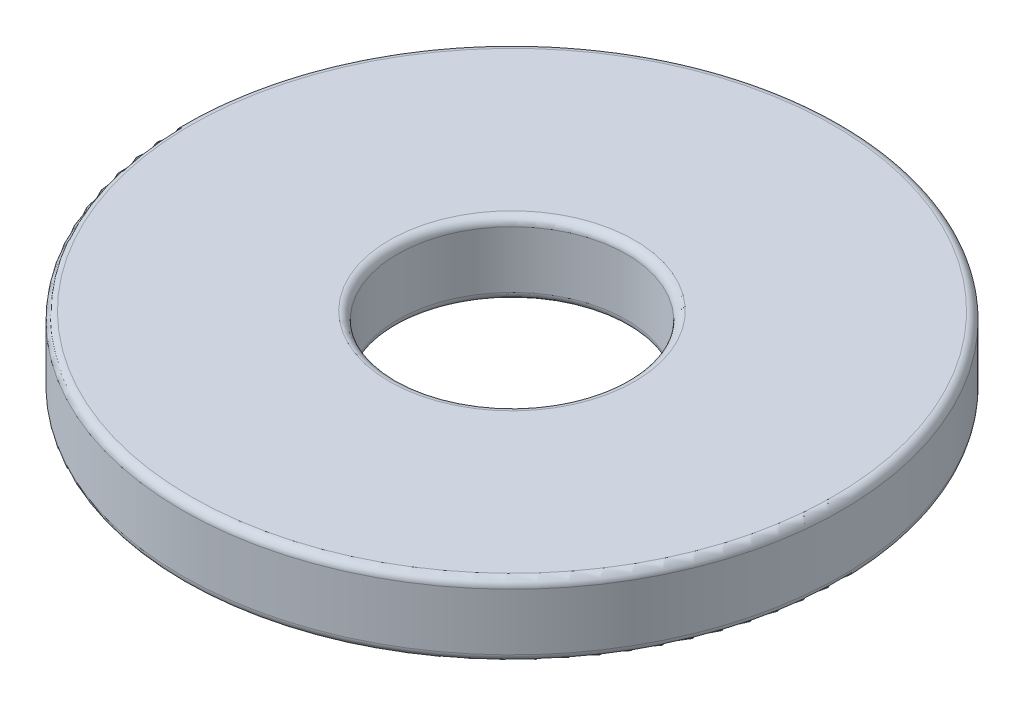
ISO-10303-21;
HEADER;
FILE_DESCRIPTION(('STEP AP214'),'2;1');
FILE_NAME('part.step','',(''),(''),'','','');
FILE_SCHEMA(('AUTOMOTIVE_DESIGN { 1 0 10303 214 1 1 1 1 }'));
ENDSEC;
DATA;
#1=APPLICATION_CONTEXT('core data for automotive mechanical design processes');
#2=APPLICATION_PROTOCOL_DEFINITION('international standard','automotive_design',2000,#1);
#3=PRODUCT_CONTEXT('',#1,'mechanical');
#4=PRODUCT('Part','Part','',(#3));
#5=PRODUCT_RELATED_PRODUCT_CATEGORY('part','',(#4));
#6=PRODUCT_DEFINITION_FORMATION('','',#4);
#7=PRODUCT_DEFINITION_CONTEXT('part definition',#1,'design');
#8=PRODUCT_DEFINITION('design','',#6,#7);
#9=PRODUCT_DEFINITION_SHAPE('','',#8);
#10=(LENGTH_UNIT() NAMED_UNIT(*) SI_UNIT(.MILLI.,.METRE.));
#11=(NAMED_UNIT(*) PLANE_ANGLE_UNIT() SI_UNIT($,.RADIAN.));
#12=(NAMED_UNIT(*) SI_UNIT($,.STERADIAN.) SOLID_ANGLE_UNIT());
#13=UNCERTAINTY_MEASURE_WITH_UNIT(LENGTH_MEASURE(1.E-05),#10,'distance_accuracy_value','');
#14=(GEOMETRIC_REPRESENTATION_CONTEXT(3) GLOBAL_UNCERTAINTY_ASSIGNED_CONTEXT((#13)) GLOBAL_UNIT_ASSIGNED_CONTEXT((#10,
#11,#12)) REPRESENTATION_CONTEXT('',''));
#15=CARTESIAN_POINT('',(0.,0.,0.));
#16=DIRECTION('',(0.,0.,1.));
#17=DIRECTION('',(1.,0.,0.));
#18=AXIS2_PLACEMENT_3D('',#15,#16,#17);
#19=CARTESIAN_POINT('',(0.,1.143,0.));
#20=DIRECTION('',(0.,1.,0.));
#21=DIRECTION('',(0.,0.,1.));
#22=AXIS2_PLACEMENT_3D('',#19,#20,#21);
#23=PLANE('',#22);
#24=CARTESIAN_POINT('',(0.,1.143,0.));
#25=DIRECTION('',(0.,1.,0.));
#26=DIRECTION('',(0.,0.,1.));
#27=AXIS2_PLACEMENT_3D('',#24,#25,#26);
#28=CIRCLE('',#27,1.9177);
#29=CARTESIAN_POINT('',(0.,1.143,1.9177));
#30=VERTEX_POINT('',#29);
#31=EDGE_CURVE('E48',#30,#30,#28,.F.);
#32=ORIENTED_EDGE('',*,*,#31,.T.);
#33=EDGE_LOOP('',(#32));
#34=FACE_BOUND('',#33,.T.);
#35=CARTESIAN_POINT('',(0.,1.143,0.));
#36=DIRECTION('',(0.,1.,0.));
#37=DIRECTION('',(0.,0.,1.));
#38=AXIS2_PLACEMENT_3D('',#35,#36,#37);
#39=CIRCLE('',#38,5.0292);
#40=CARTESIAN_POINT('',(0.,1.143,5.0292));
#41=VERTEX_POINT('',#40);
#42=EDGE_CURVE('E76',#41,#41,#39,.T.);
#43=ORIENTED_EDGE('',*,*,#42,.T.);
#44=EDGE_LOOP('',(#43));
#45=FACE_BOUND('',#44,.T.);
#46=ADVANCED_FACE('F40',(#34,#45),#23,.T.);
#47=CARTESIAN_POINT('',(0.,0.,0.));
#48=DIRECTION('',(0.,1.,0.));
#49=DIRECTION('',(0.,0.,1.));
#50=AXIS2_PLACEMENT_3D('',#47,#48,#49);
#51=PLANE('',#50);
#52=CARTESIAN_POINT('',(0.,0.,0.));
#53=DIRECTION('',(0.,1.,0.));
#54=DIRECTION('',(0.,0.,1.));
#55=AXIS2_PLACEMENT_3D('',#52,#53,#54);
#56=CIRCLE('',#55,1.9177);
#57=CARTESIAN_POINT('',(0.,0.,1.9177));
#58=VERTEX_POINT('',#57);
#59=EDGE_CURVE('E10',#58,#58,#56,.T.);
#60=ORIENTED_EDGE('',*,*,#59,.T.);
#61=EDGE_LOOP('',(#60));
#62=FACE_BOUND('',#61,.T.);
#63=CARTESIAN_POINT('',(0.,0.,0.));
#64=DIRECTION('',(0.,1.,0.));
#65=DIRECTION('',(0.,0.,1.));
#66=AXIS2_PLACEMENT_3D('',#63,#64,#65);
#67=CIRCLE('',#66,5.0292);
#68=CARTESIAN_POINT('',(0.,0.,5.0292));
#69=VERTEX_POINT('',#68);
#70=EDGE_CURVE('E64',#69,#69,#67,.F.);
#71=ORIENTED_EDGE('',*,*,#70,.T.);
#72=EDGE_LOOP('',(#71));
#73=FACE_BOUND('',#72,.T.);
#74=ADVANCED_FACE('F101',(#62,#73),#51,.F.);
#75=CARTESIAN_POINT('',(0.,1.143,0.));
#76=DIRECTION('',(0.,-1.,0.));
#77=DIRECTION('',(0.,0.,-1.));
#78=AXIS2_PLACEMENT_3D('',#75,#76,#77);
#79=CYLINDRICAL_SURFACE('',#78,5.1562);
#80=CARTESIAN_POINT('',(0.,0.127,0.));
#81=DIRECTION('',(0.,1.,0.));
#82=DIRECTION('',(0.,0.,1.));
#83=AXIS2_PLACEMENT_3D('',#80,#81,#82);
#84=CIRCLE('',#83,5.1562);
#85=CARTESIAN_POINT('',(0.,0.127,5.1562));
#86=VERTEX_POINT('',#85);
#87=EDGE_CURVE('E68',#86,#86,#84,.T.);
#88=ORIENTED_EDGE('',*,*,#87,.T.);
#89=EDGE_LOOP('',(#88));
#90=FACE_BOUND('',#89,.T.);
#91=CARTESIAN_POINT('',(0.,1.016,0.));
#92=DIRECTION('',(0.,1.,0.));
#93=DIRECTION('',(0.,0.,1.));
#94=AXIS2_PLACEMENT_3D('',#91,#92,#93);
#95=CIRCLE('',#94,5.1562);
#96=CARTESIAN_POINT('',(0.,1.016,5.1562));
#97=VERTEX_POINT('',#96);
#98=EDGE_CURVE('E72',#97,#97,#95,.F.);
#99=ORIENTED_EDGE('',*,*,#98,.T.);
#100=EDGE_LOOP('',(#99));
#101=FACE_BOUND('',#100,.T.);
#102=ADVANCED_FACE('F95',(#90,#101),#79,.T.);
#103=CARTESIAN_POINT('',(0.,1.143,0.));
#104=DIRECTION('',(0.,-1.,0.));
#105=DIRECTION('',(0.,0.,-1.));
#106=AXIS2_PLACEMENT_3D('',#103,#104,#105);
#107=CYLINDRICAL_SURFACE('',#106,1.7907);
#108=CARTESIAN_POINT('',(0.,1.016,0.));
#109=DIRECTION('',(0.,1.,0.));
#110=DIRECTION('',(0.,0.,1.));
#111=AXIS2_PLACEMENT_3D('',#108,#109,#110);
#112=CIRCLE('',#111,1.7907);
#113=CARTESIAN_POINT('',(0.,1.016,1.7907));
#114=VERTEX_POINT('',#113);
#115=EDGE_CURVE('E53',#114,#114,#112,.T.);
#116=ORIENTED_EDGE('',*,*,#115,.T.);
#117=EDGE_LOOP('',(#116));
#118=FACE_BOUND('',#117,.T.);
#119=CARTESIAN_POINT('',(0.,0.127,0.));
#120=DIRECTION('',(0.,1.,0.));
#121=DIRECTION('',(0.,0.,1.));
#122=AXIS2_PLACEMENT_3D('',#119,#120,#121);
#123=CIRCLE('',#122,1.7907);
#124=CARTESIAN_POINT('',(0.,0.127,1.7907));
#125=VERTEX_POINT('',#124);
#126=EDGE_CURVE('E58',#125,#125,#123,.F.);
#127=ORIENTED_EDGE('',*,*,#126,.T.);
#128=EDGE_LOOP('',(#127));
#129=FACE_BOUND('',#128,.T.);
#130=ADVANCED_FACE('F85',(#118,#129),#107,.F.);
#131=CARTESIAN_POINT('',(0.,1.016,0.));
#132=DIRECTION('',(0.,1.,0.));
#133=DIRECTION('',(0.,0.,1.));
#134=AXIS2_PLACEMENT_3D('',#131,#132,#133);
#135=TOROIDAL_SURFACE('',#134,5.0292,0.127);
#136=ORIENTED_EDGE('',*,*,#98,.F.);
#137=EDGE_LOOP('',(#136));
#138=FACE_BOUND('',#137,.T.);
#139=ORIENTED_EDGE('',*,*,#42,.F.);
#140=EDGE_LOOP('',(#139));
#141=FACE_BOUND('',#140,.T.);
#142=ADVANCED_FACE('F82',(#138,#141),#135,.T.);
#143=CARTESIAN_POINT('',(0.,0.127,0.));
#144=DIRECTION('',(0.,1.,0.));
#145=DIRECTION('',(0.,0.,1.));
#146=AXIS2_PLACEMENT_3D('',#143,#144,#145);
#147=TOROIDAL_SURFACE('',#146,5.0292,0.127);
#148=ORIENTED_EDGE('',*,*,#70,.F.);
#149=EDGE_LOOP('',(#148));
#150=FACE_BOUND('',#149,.T.);
#151=ORIENTED_EDGE('',*,*,#87,.F.);
#152=EDGE_LOOP('',(#151));
#153=FACE_BOUND('',#152,.T.);
#154=ADVANCED_FACE('F84',(#150,#153),#147,.T.);
#155=CARTESIAN_POINT('',(0.,1.016,0.));
#156=DIRECTION('',(0.,1.,0.));
#157=DIRECTION('',(0.,0.,1.));
#158=AXIS2_PLACEMENT_3D('',#155,#156,#157);
#159=TOROIDAL_SURFACE('',#158,1.9177,0.127);
#160=ORIENTED_EDGE('',*,*,#31,.F.);
#161=EDGE_LOOP('',(#160));
#162=FACE_BOUND('',#161,.T.);
#163=ORIENTED_EDGE('',*,*,#115,.F.);
#164=EDGE_LOOP('',(#163));
#165=FACE_BOUND('',#164,.T.);
#166=ADVANCED_FACE('F92',(#162,#165),#159,.T.);
#167=CARTESIAN_POINT('',(0.,0.127,0.));
#168=DIRECTION('',(0.,1.,0.));
#169=DIRECTION('',(0.,0.,1.));
#170=AXIS2_PLACEMENT_3D('',#167,#168,#169);
#171=TOROIDAL_SURFACE('',#170,1.9177,0.127);
#172=ORIENTED_EDGE('',*,*,#126,.F.);
#173=EDGE_LOOP('',(#172));
#174=FACE_BOUND('',#173,.T.);
#175=ORIENTED_EDGE('',*,*,#59,.F.);
#176=EDGE_LOOP('',(#175));
#177=FACE_BOUND('',#176,.T.);
#178=ADVANCED_FACE('F42',(#174,#177),#171,.T.);
#179=CLOSED_SHELL('',(#46,#74,#102,#130,#142,#154,#166,#178));
#180=MANIFOLD_SOLID_BREP('B2',#179);
#181=ADVANCED_BREP_SHAPE_REPRESENTATION('',(#18,#180),#14);
#182=SHAPE_DEFINITION_REPRESENTATION(#9,#181);
ENDSEC;
END-ISO-10303-21;
